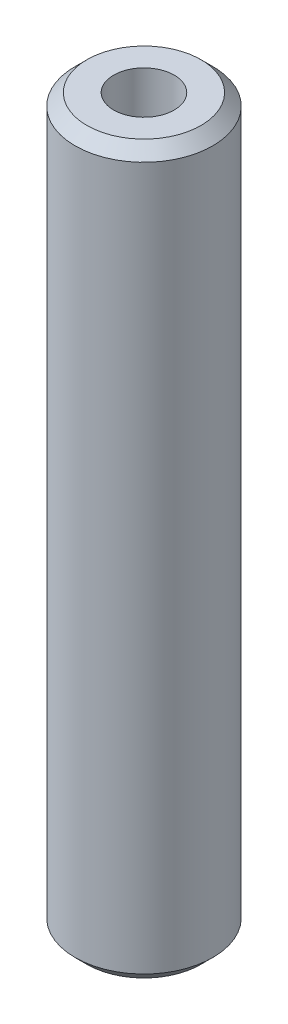
ISO-10303-21;
HEADER;
FILE_DESCRIPTION(('STEP AP214'),'2;1');
FILE_NAME('part.step','',(''),(''),'','','');
FILE_SCHEMA(('AUTOMOTIVE_DESIGN { 1 0 10303 214 1 1 1 1 }'));
ENDSEC;
DATA;
#1=APPLICATION_CONTEXT('core data for automotive mechanical design processes');
#2=APPLICATION_PROTOCOL_DEFINITION('international standard','automotive_design',2000,#1);
#3=PRODUCT_CONTEXT('',#1,'mechanical');
#4=PRODUCT('Part','Part','',(#3));
#5=PRODUCT_RELATED_PRODUCT_CATEGORY('part','',(#4));
#6=PRODUCT_DEFINITION_FORMATION('','',#4);
#7=PRODUCT_DEFINITION_CONTEXT('part definition',#1,'design');
#8=PRODUCT_DEFINITION('design','',#6,#7);
#9=PRODUCT_DEFINITION_SHAPE('','',#8);
#10=(LENGTH_UNIT() NAMED_UNIT(*) SI_UNIT(.MILLI.,.METRE.));
#11=(NAMED_UNIT(*) PLANE_ANGLE_UNIT() SI_UNIT($,.RADIAN.));
#12=(NAMED_UNIT(*) SI_UNIT($,.STERADIAN.) SOLID_ANGLE_UNIT());
#13=UNCERTAINTY_MEASURE_WITH_UNIT(LENGTH_MEASURE(1.E-05),#10,'distance_accuracy_value','');
#14=(GEOMETRIC_REPRESENTATION_CONTEXT(3) GLOBAL_UNCERTAINTY_ASSIGNED_CONTEXT((#13)) GLOBAL_UNIT_ASSIGNED_CONTEXT((#10,
#11,#12)) REPRESENTATION_CONTEXT('',''));
#15=CARTESIAN_POINT('',(0.,0.,0.));
#16=DIRECTION('',(0.,0.,1.));
#17=DIRECTION('',(1.,0.,0.));
#18=AXIS2_PLACEMENT_3D('',#15,#16,#17);
#19=CARTESIAN_POINT('',(0.,52.7982895797091,0.));
#20=DIRECTION('',(0.,-1.,0.));
#21=DIRECTION('',(0.,0.,-1.));
#22=AXIS2_PLACEMENT_3D('',#19,#20,#21);
#23=CYLINDRICAL_SURFACE('',#22,5.);
#24=CARTESIAN_POINT('',(0.,51.9435082532814,0.));
#25=DIRECTION('',(0.,1.,0.));
#26=DIRECTION('',(0.,0.,1.));
#27=AXIS2_PLACEMENT_3D('',#24,#25,#26);
#28=CIRCLE('',#27,5.);
#29=CARTESIAN_POINT('',(0.,51.9435082532814,5.));
#30=VERTEX_POINT('',#29);
#31=EDGE_CURVE('E50',#30,#30,#28,.F.);
#32=ORIENTED_EDGE('',*,*,#31,.T.);
#33=EDGE_LOOP('',(#32));
#34=FACE_BOUND('',#33,.T.);
#35=CARTESIAN_POINT('',(0.,0.854781326427717,0.));
#36=DIRECTION('',(0.,1.,0.));
#37=DIRECTION('',(0.,0.,1.));
#38=AXIS2_PLACEMENT_3D('',#35,#36,#37);
#39=CIRCLE('',#38,5.);
#40=CARTESIAN_POINT('',(0.,0.854781326427717,5.));
#41=VERTEX_POINT('',#40);
#42=EDGE_CURVE('E51',#41,#41,#39,.T.);
#43=ORIENTED_EDGE('',*,*,#42,.T.);
#44=EDGE_LOOP('',(#43));
#45=FACE_BOUND('',#44,.T.);
#46=ADVANCED_FACE('F39',(#34,#45),#23,.T.);
#47=CARTESIAN_POINT('',(0.,52.7982895797091,0.));
#48=DIRECTION('',(0.,1.,0.));
#49=DIRECTION('',(0.,0.,1.));
#50=AXIS2_PLACEMENT_3D('',#47,#48,#49);
#51=PLANE('',#50);
#52=CARTESIAN_POINT('',(0.,52.7982895797091,0.));
#53=DIRECTION('',(0.,1.,0.));
#54=DIRECTION('',(0.,0.,1.));
#55=AXIS2_PLACEMENT_3D('',#52,#53,#54);
#56=CIRCLE('',#55,4.14521867357227);
#57=CARTESIAN_POINT('',(0.,52.7982895797091,4.14521867357227));
#58=VERTEX_POINT('',#57);
#59=EDGE_CURVE('E54',#58,#58,#56,.T.);
#60=ORIENTED_EDGE('',*,*,#59,.T.);
#61=EDGE_LOOP('',(#60));
#62=FACE_BOUND('',#61,.T.);
#63=CARTESIAN_POINT('',(0.,52.7982895797091,0.));
#64=DIRECTION('',(0.,1.,0.));
#65=DIRECTION('',(0.,0.,1.));
#66=AXIS2_PLACEMENT_3D('',#63,#64,#65);
#67=CIRCLE('',#66,2.20039888962716);
#68=CARTESIAN_POINT('',(0.,52.7982895797091,2.20039888962716));
#69=VERTEX_POINT('',#68);
#70=EDGE_CURVE('E58',#69,#69,#67,.T.);
#71=ORIENTED_EDGE('',*,*,#70,.F.);
#72=EDGE_LOOP('',(#71));
#73=FACE_BOUND('',#72,.T.);
#74=ADVANCED_FACE('F69',(#62,#73),#51,.T.);
#75=CARTESIAN_POINT('',(0.,0.,0.));
#76=DIRECTION('',(0.,1.,0.));
#77=DIRECTION('',(0.,0.,1.));
#78=AXIS2_PLACEMENT_3D('',#75,#76,#77);
#79=PLANE('',#78);
#80=CARTESIAN_POINT('',(0.,0.,0.));
#81=DIRECTION('',(0.,1.,0.));
#82=DIRECTION('',(0.,0.,1.));
#83=AXIS2_PLACEMENT_3D('',#80,#81,#82);
#84=CIRCLE('',#83,4.14521867357227);
#85=CARTESIAN_POINT('',(0.,0.,4.14521867357227));
#86=VERTEX_POINT('',#85);
#87=EDGE_CURVE('E10',#86,#86,#84,.F.);
#88=ORIENTED_EDGE('',*,*,#87,.T.);
#89=EDGE_LOOP('',(#88));
#90=FACE_BOUND('',#89,.T.);
#91=CARTESIAN_POINT('',(0.,0.,0.));
#92=DIRECTION('',(0.,1.,0.));
#93=DIRECTION('',(0.,0.,1.));
#94=AXIS2_PLACEMENT_3D('',#91,#92,#93);
#95=CIRCLE('',#94,2.20039888962716);
#96=CARTESIAN_POINT('',(0.,0.,2.20039888962716));
#97=VERTEX_POINT('',#96);
#98=EDGE_CURVE('E63',#97,#97,#95,.T.);
#99=ORIENTED_EDGE('',*,*,#98,.T.);
#100=EDGE_LOOP('',(#99));
#101=FACE_BOUND('',#100,.T.);
#102=ADVANCED_FACE('F75',(#90,#101),#79,.F.);
#103=CARTESIAN_POINT('',(0.,52.7982895797091,0.));
#104=DIRECTION('',(0.,-1.,0.));
#105=DIRECTION('',(0.,0.,-1.));
#106=AXIS2_PLACEMENT_3D('',#103,#104,#105);
#107=CYLINDRICAL_SURFACE('',#106,2.20039888962716);
#108=ORIENTED_EDGE('',*,*,#70,.T.);
#109=EDGE_LOOP('',(#108));
#110=FACE_BOUND('',#109,.T.);
#111=ORIENTED_EDGE('',*,*,#98,.F.);
#112=EDGE_LOOP('',(#111));
#113=FACE_BOUND('',#112,.T.);
#114=ADVANCED_FACE('F70',(#110,#113),#107,.F.);
#115=CARTESIAN_POINT('',(0.,52.7982895797091,0.));
#116=DIRECTION('',(0.,-1.,0.));
#117=DIRECTION('',(0.,0.,-1.));
#118=AXIS2_PLACEMENT_3D('',#115,#116,#117);
#119=CONICAL_SURFACE('',#118,4.14521867357227,0.785398163397446);
#120=ORIENTED_EDGE('',*,*,#31,.F.);
#121=EDGE_LOOP('',(#120));
#122=FACE_BOUND('',#121,.T.);
#123=ORIENTED_EDGE('',*,*,#59,.F.);
#124=EDGE_LOOP('',(#123));
#125=FACE_BOUND('',#124,.T.);
#126=ADVANCED_FACE('F81',(#122,#125),#119,.T.);
#127=CARTESIAN_POINT('',(0.,0.854781326427717,0.));
#128=DIRECTION('',(0.,1.,0.));
#129=DIRECTION('',(0.,0.,1.));
#130=AXIS2_PLACEMENT_3D('',#127,#128,#129);
#131=CONICAL_SURFACE('',#130,5.,0.785398163397458);
#132=ORIENTED_EDGE('',*,*,#87,.F.);
#133=EDGE_LOOP('',(#132));
#134=FACE_BOUND('',#133,.T.);
#135=ORIENTED_EDGE('',*,*,#42,.F.);
#136=EDGE_LOOP('',(#135));
#137=FACE_BOUND('',#136,.T.);
#138=ADVANCED_FACE('F45',(#134,#137),#131,.T.);
#139=CLOSED_SHELL('',(#46,#74,#102,#114,#126,#138));
#140=MANIFOLD_SOLID_BREP('B2',#139);
#141=ADVANCED_BREP_SHAPE_REPRESENTATION('',(#18,#140),#14);
#142=SHAPE_DEFINITION_REPRESENTATION(#9,#141);
ENDSEC;
END-ISO-10303-21;
